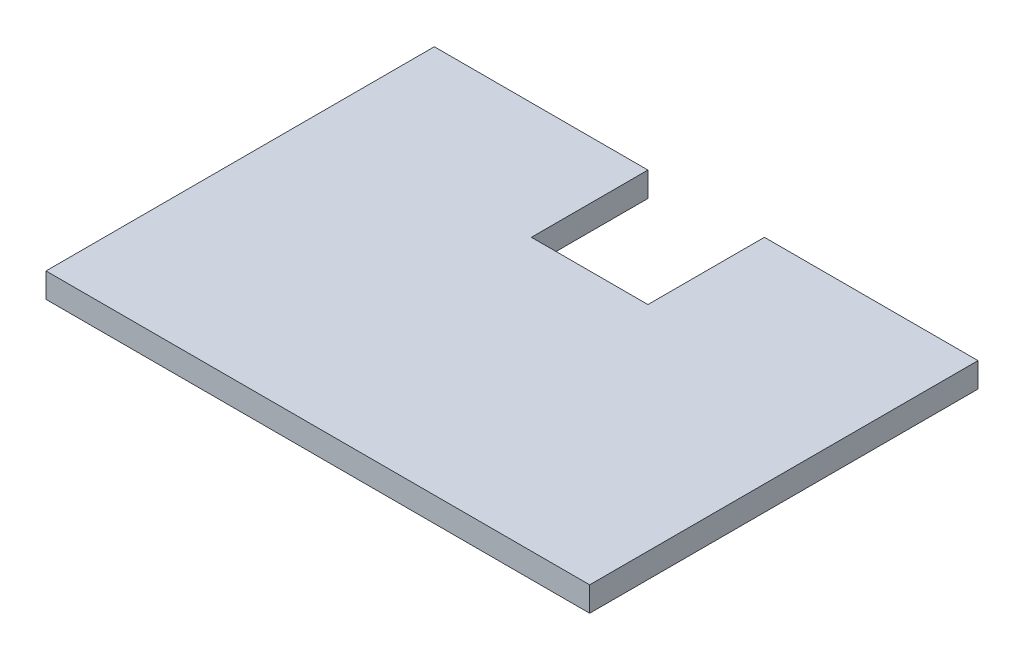
ISO-10303-21;
HEADER;
FILE_DESCRIPTION(('STEP AP214'),'2;1');
FILE_NAME('part.step','',(''),(''),'','','');
FILE_SCHEMA(('AUTOMOTIVE_DESIGN { 1 0 10303 214 1 1 1 1 }'));
ENDSEC;
DATA;
#1=APPLICATION_CONTEXT('core data for automotive mechanical design processes');
#2=APPLICATION_PROTOCOL_DEFINITION('international standard','automotive_design',2000,#1);
#3=PRODUCT_CONTEXT('',#1,'mechanical');
#4=PRODUCT('Part','Part','',(#3));
#5=PRODUCT_RELATED_PRODUCT_CATEGORY('part','',(#4));
#6=PRODUCT_DEFINITION_FORMATION('','',#4);
#7=PRODUCT_DEFINITION_CONTEXT('part definition',#1,'design');
#8=PRODUCT_DEFINITION('design','',#6,#7);
#9=PRODUCT_DEFINITION_SHAPE('','',#8);
#10=(LENGTH_UNIT() NAMED_UNIT(*) SI_UNIT(.MILLI.,.METRE.));
#11=(NAMED_UNIT(*) PLANE_ANGLE_UNIT() SI_UNIT($,.RADIAN.));
#12=(NAMED_UNIT(*) SI_UNIT($,.STERADIAN.) SOLID_ANGLE_UNIT());
#13=UNCERTAINTY_MEASURE_WITH_UNIT(LENGTH_MEASURE(1.E-05),#10,'distance_accuracy_value','');
#14=(GEOMETRIC_REPRESENTATION_CONTEXT(3) GLOBAL_UNCERTAINTY_ASSIGNED_CONTEXT((#13)) GLOBAL_UNIT_ASSIGNED_CONTEXT((#10,
#11,#12)) REPRESENTATION_CONTEXT('',''));
#15=CARTESIAN_POINT('',(0.,0.,0.));
#16=DIRECTION('',(0.,0.,1.));
#17=DIRECTION('',(1.,0.,0.));
#18=AXIS2_PLACEMENT_3D('',#15,#16,#17);
#19=CARTESIAN_POINT('',(-35.,3.175,-25.));
#20=DIRECTION('',(0.,0.,1.));
#21=DIRECTION('',(1.,0.,0.));
#22=AXIS2_PLACEMENT_3D('',#19,#20,#21);
#23=PLANE('',#22);
#24=DIRECTION('',(-1.,0.,0.));
#25=VECTOR('',#24,1.);
#26=CARTESIAN_POINT('',(-35.,3.175,-25.));
#27=LINE('',#26,#25);
#28=CARTESIAN_POINT('',(-7.49999999999999,3.175,-25.));
#29=VERTEX_POINT('',#28);
#30=CARTESIAN_POINT('',(-35.,3.175,-25.));
#31=VERTEX_POINT('',#30);
#32=EDGE_CURVE('E144',#29,#31,#27,.T.);
#33=ORIENTED_EDGE('',*,*,#32,.F.);
#34=DIRECTION('',(0.,1.,0.));
#35=VECTOR('',#34,1.);
#36=CARTESIAN_POINT('',(-7.49999999999999,0.,-25.));
#37=LINE('',#36,#35);
#38=CARTESIAN_POINT('',(-7.49999999999999,0.,-25.));
#39=VERTEX_POINT('',#38);
#40=EDGE_CURVE('E136',#39,#29,#37,.T.);
#41=ORIENTED_EDGE('',*,*,#40,.F.);
#42=DIRECTION('',(-1.,0.,0.));
#43=VECTOR('',#42,1.);
#44=CARTESIAN_POINT('',(-35.,0.,-25.));
#45=LINE('',#44,#43);
#46=CARTESIAN_POINT('',(-35.,0.,-25.));
#47=VERTEX_POINT('',#46);
#48=EDGE_CURVE('E127',#39,#47,#45,.T.);
#49=ORIENTED_EDGE('',*,*,#48,.T.);
#50=DIRECTION('',(0.,-1.,0.));
#51=VECTOR('',#50,1.);
#52=CARTESIAN_POINT('',(-35.,3.175,-25.));
#53=LINE('',#52,#51);
#54=EDGE_CURVE('E40',#31,#47,#53,.T.);
#55=ORIENTED_EDGE('',*,*,#54,.F.);
#56=EDGE_LOOP('',(#33,#41,#49,#55));
#57=FACE_BOUND('',#56,.T.);
#58=ADVANCED_FACE('F32',(#57),#23,.F.);
#59=CARTESIAN_POINT('',(35.,3.175,-25.));
#60=DIRECTION('',(-1.,0.,0.));
#61=DIRECTION('',(0.,0.,1.));
#62=AXIS2_PLACEMENT_3D('',#59,#60,#61);
#63=PLANE('',#62);
#64=DIRECTION('',(0.,0.,-1.));
#65=VECTOR('',#64,1.);
#66=CARTESIAN_POINT('',(35.,0.,-25.));
#67=LINE('',#66,#65);
#68=CARTESIAN_POINT('',(35.,0.,25.));
#69=VERTEX_POINT('',#68);
#70=CARTESIAN_POINT('',(35.,0.,-25.));
#71=VERTEX_POINT('',#70);
#72=EDGE_CURVE('E138',#69,#71,#67,.T.);
#73=ORIENTED_EDGE('',*,*,#72,.T.);
#74=DIRECTION('',(0.,-1.,0.));
#75=VECTOR('',#74,1.);
#76=CARTESIAN_POINT('',(35.,3.175,-25.));
#77=LINE('',#76,#75);
#78=CARTESIAN_POINT('',(35.,3.175,-25.));
#79=VERTEX_POINT('',#78);
#80=EDGE_CURVE('E11',#79,#71,#77,.T.);
#81=ORIENTED_EDGE('',*,*,#80,.F.);
#82=DIRECTION('',(0.,0.,-1.));
#83=VECTOR('',#82,1.);
#84=CARTESIAN_POINT('',(35.,3.175,-25.));
#85=LINE('',#84,#83);
#86=CARTESIAN_POINT('',(35.,3.175,25.));
#87=VERTEX_POINT('',#86);
#88=EDGE_CURVE('E142',#87,#79,#85,.T.);
#89=ORIENTED_EDGE('',*,*,#88,.F.);
#90=DIRECTION('',(0.,-1.,0.));
#91=VECTOR('',#90,1.);
#92=CARTESIAN_POINT('',(35.,3.175,25.));
#93=LINE('',#92,#91);
#94=EDGE_CURVE('E149',#87,#69,#93,.T.);
#95=ORIENTED_EDGE('',*,*,#94,.T.);
#96=EDGE_LOOP('',(#73,#81,#89,#95));
#97=FACE_BOUND('',#96,.T.);
#98=ADVANCED_FACE('F34',(#97),#63,.F.);
#99=CARTESIAN_POINT('',(7.5,0.,-25.));
#100=VERTEX_POINT('',#99);
#101=EDGE_CURVE('E152',#71,#100,#45,.T.);
#102=ORIENTED_EDGE('',*,*,#101,.T.);
#103=DIRECTION('',(0.,1.,0.));
#104=VECTOR('',#103,1.);
#105=CARTESIAN_POINT('',(7.5,0.,-25.));
#106=LINE('',#105,#104);
#107=CARTESIAN_POINT('',(7.5,3.175,-25.));
#108=VERTEX_POINT('',#107);
#109=EDGE_CURVE('E139',#100,#108,#106,.T.);
#110=ORIENTED_EDGE('',*,*,#109,.T.);
#111=EDGE_CURVE('E84',#79,#108,#27,.T.);
#112=ORIENTED_EDGE('',*,*,#111,.F.);
#113=ORIENTED_EDGE('',*,*,#80,.T.);
#114=EDGE_LOOP('',(#102,#110,#112,#113));
#115=FACE_BOUND('',#114,.T.);
#116=ADVANCED_FACE('F181',(#115),#23,.F.);
#117=CARTESIAN_POINT('',(-35.,3.175,-25.));
#118=DIRECTION('',(1.,0.,0.));
#119=DIRECTION('',(0.,0.,-1.));
#120=AXIS2_PLACEMENT_3D('',#117,#118,#119);
#121=PLANE('',#120);
#122=DIRECTION('',(0.,0.,1.));
#123=VECTOR('',#122,1.);
#124=CARTESIAN_POINT('',(-35.,0.,-25.));
#125=LINE('',#124,#123);
#126=CARTESIAN_POINT('',(-35.,0.,25.));
#127=VERTEX_POINT('',#126);
#128=EDGE_CURVE('E155',#47,#127,#125,.T.);
#129=ORIENTED_EDGE('',*,*,#128,.T.);
#130=DIRECTION('',(0.,-1.,0.));
#131=VECTOR('',#130,1.);
#132=CARTESIAN_POINT('',(-35.,3.175,25.));
#133=LINE('',#132,#131);
#134=CARTESIAN_POINT('',(-35.,3.175,25.));
#135=VERTEX_POINT('',#134);
#136=EDGE_CURVE('E159',#135,#127,#133,.T.);
#137=ORIENTED_EDGE('',*,*,#136,.F.);
#138=DIRECTION('',(0.,0.,1.));
#139=VECTOR('',#138,1.);
#140=CARTESIAN_POINT('',(-35.,3.175,-25.));
#141=LINE('',#140,#139);
#142=EDGE_CURVE('E146',#31,#135,#141,.T.);
#143=ORIENTED_EDGE('',*,*,#142,.F.);
#144=ORIENTED_EDGE('',*,*,#54,.T.);
#145=EDGE_LOOP('',(#129,#137,#143,#144));
#146=FACE_BOUND('',#145,.T.);
#147=ADVANCED_FACE('F164',(#146),#121,.F.);
#148=CARTESIAN_POINT('',(-35.,3.175,25.));
#149=DIRECTION('',(0.,0.,-1.));
#150=DIRECTION('',(-1.,0.,0.));
#151=AXIS2_PLACEMENT_3D('',#148,#149,#150);
#152=PLANE('',#151);
#153=DIRECTION('',(1.,0.,0.));
#154=VECTOR('',#153,1.);
#155=CARTESIAN_POINT('',(-35.,0.,25.));
#156=LINE('',#155,#154);
#157=EDGE_CURVE('E77',#127,#69,#156,.T.);
#158=ORIENTED_EDGE('',*,*,#157,.T.);
#159=ORIENTED_EDGE('',*,*,#94,.F.);
#160=DIRECTION('',(1.,0.,0.));
#161=VECTOR('',#160,1.);
#162=CARTESIAN_POINT('',(-35.,3.175,25.));
#163=LINE('',#162,#161);
#164=EDGE_CURVE('E56',#135,#87,#163,.T.);
#165=ORIENTED_EDGE('',*,*,#164,.F.);
#166=ORIENTED_EDGE('',*,*,#136,.T.);
#167=EDGE_LOOP('',(#158,#159,#165,#166));
#168=FACE_BOUND('',#167,.T.);
#169=ADVANCED_FACE('F172',(#168),#152,.F.);
#170=CARTESIAN_POINT('',(0.,3.175,0.));
#171=DIRECTION('',(0.,1.,0.));
#172=DIRECTION('',(0.,0.,1.));
#173=AXIS2_PLACEMENT_3D('',#170,#171,#172);
#174=PLANE('',#173);
#175=DIRECTION('',(0.,0.,1.));
#176=VECTOR('',#175,1.);
#177=CARTESIAN_POINT('',(-7.49999999999999,3.175,-25.));
#178=LINE('',#177,#176);
#179=CARTESIAN_POINT('',(-7.5,3.175,-10.));
#180=VERTEX_POINT('',#179);
#181=EDGE_CURVE('E113',#29,#180,#178,.T.);
#182=ORIENTED_EDGE('',*,*,#181,.F.);
#183=ORIENTED_EDGE('',*,*,#32,.T.);
#184=ORIENTED_EDGE('',*,*,#142,.T.);
#185=ORIENTED_EDGE('',*,*,#164,.T.);
#186=ORIENTED_EDGE('',*,*,#88,.T.);
#187=ORIENTED_EDGE('',*,*,#111,.T.);
#188=DIRECTION('',(0.,0.,-1.));
#189=VECTOR('',#188,1.);
#190=CARTESIAN_POINT('',(7.5,3.175,-25.));
#191=LINE('',#190,#189);
#192=CARTESIAN_POINT('',(7.5,3.175,-10.));
#193=VERTEX_POINT('',#192);
#194=EDGE_CURVE('E128',#193,#108,#191,.T.);
#195=ORIENTED_EDGE('',*,*,#194,.F.);
#196=DIRECTION('',(1.,0.,0.));
#197=VECTOR('',#196,1.);
#198=CARTESIAN_POINT('',(-7.5,3.175,-10.));
#199=LINE('',#198,#197);
#200=EDGE_CURVE('E130',#180,#193,#199,.T.);
#201=ORIENTED_EDGE('',*,*,#200,.F.);
#202=EDGE_LOOP('',(#182,#183,#184,#185,#186,#187,#195,#201));
#203=FACE_BOUND('',#202,.T.);
#204=ADVANCED_FACE('F174',(#203),#174,.T.);
#205=CARTESIAN_POINT('',(0.,0.,0.));
#206=DIRECTION('',(0.,1.,0.));
#207=DIRECTION('',(0.,0.,1.));
#208=AXIS2_PLACEMENT_3D('',#205,#206,#207);
#209=PLANE('',#208);
#210=ORIENTED_EDGE('',*,*,#48,.F.);
#211=DIRECTION('',(0.,0.,1.));
#212=VECTOR('',#211,1.);
#213=CARTESIAN_POINT('',(-7.49999999999999,0.,-25.));
#214=LINE('',#213,#212);
#215=CARTESIAN_POINT('',(-7.5,0.,-10.));
#216=VERTEX_POINT('',#215);
#217=EDGE_CURVE('E110',#39,#216,#214,.T.);
#218=ORIENTED_EDGE('',*,*,#217,.T.);
#219=DIRECTION('',(1.,0.,0.));
#220=VECTOR('',#219,1.);
#221=CARTESIAN_POINT('',(-7.5,0.,-10.));
#222=LINE('',#221,#220);
#223=CARTESIAN_POINT('',(7.5,0.,-10.));
#224=VERTEX_POINT('',#223);
#225=EDGE_CURVE('E120',#216,#224,#222,.T.);
#226=ORIENTED_EDGE('',*,*,#225,.T.);
#227=DIRECTION('',(0.,0.,-1.));
#228=VECTOR('',#227,1.);
#229=CARTESIAN_POINT('',(7.5,0.,-25.));
#230=LINE('',#229,#228);
#231=EDGE_CURVE('E47',#224,#100,#230,.T.);
#232=ORIENTED_EDGE('',*,*,#231,.T.);
#233=ORIENTED_EDGE('',*,*,#101,.F.);
#234=ORIENTED_EDGE('',*,*,#72,.F.);
#235=ORIENTED_EDGE('',*,*,#157,.F.);
#236=ORIENTED_EDGE('',*,*,#128,.F.);
#237=EDGE_LOOP('',(#210,#218,#226,#232,#233,#234,#235,#236));
#238=FACE_BOUND('',#237,.T.);
#239=ADVANCED_FACE('F125',(#238),#209,.F.);
#240=CARTESIAN_POINT('',(-7.49999999999999,0.,-25.));
#241=DIRECTION('',(-1.,0.,0.));
#242=DIRECTION('',(0.,0.,1.));
#243=AXIS2_PLACEMENT_3D('',#240,#241,#242);
#244=PLANE('',#243);
#245=ORIENTED_EDGE('',*,*,#181,.T.);
#246=DIRECTION('',(0.,1.,0.));
#247=VECTOR('',#246,1.);
#248=CARTESIAN_POINT('',(-7.5,0.,-10.));
#249=LINE('',#248,#247);
#250=EDGE_CURVE('E106',#216,#180,#249,.T.);
#251=ORIENTED_EDGE('',*,*,#250,.F.);
#252=ORIENTED_EDGE('',*,*,#217,.F.);
#253=ORIENTED_EDGE('',*,*,#40,.T.);
#254=EDGE_LOOP('',(#245,#251,#252,#253));
#255=FACE_BOUND('',#254,.T.);
#256=ADVANCED_FACE('F108',(#255),#244,.F.);
#257=CARTESIAN_POINT('',(7.5,0.,-25.));
#258=DIRECTION('',(1.,0.,0.));
#259=DIRECTION('',(0.,0.,-1.));
#260=AXIS2_PLACEMENT_3D('',#257,#258,#259);
#261=PLANE('',#260);
#262=ORIENTED_EDGE('',*,*,#194,.T.);
#263=ORIENTED_EDGE('',*,*,#109,.F.);
#264=ORIENTED_EDGE('',*,*,#231,.F.);
#265=DIRECTION('',(0.,1.,0.));
#266=VECTOR('',#265,1.);
#267=CARTESIAN_POINT('',(7.5,0.,-10.));
#268=LINE('',#267,#266);
#269=EDGE_CURVE('E117',#224,#193,#268,.T.);
#270=ORIENTED_EDGE('',*,*,#269,.T.);
#271=EDGE_LOOP('',(#262,#263,#264,#270));
#272=FACE_BOUND('',#271,.T.);
#273=ADVANCED_FACE('F192',(#272),#261,.F.);
#274=CARTESIAN_POINT('',(-7.5,0.,-10.));
#275=DIRECTION('',(0.,0.,1.));
#276=DIRECTION('',(1.,0.,0.));
#277=AXIS2_PLACEMENT_3D('',#274,#275,#276);
#278=PLANE('',#277);
#279=ORIENTED_EDGE('',*,*,#200,.T.);
#280=ORIENTED_EDGE('',*,*,#269,.F.);
#281=ORIENTED_EDGE('',*,*,#225,.F.);
#282=ORIENTED_EDGE('',*,*,#250,.T.);
#283=EDGE_LOOP('',(#279,#280,#281,#282));
#284=FACE_BOUND('',#283,.T.);
#285=ADVANCED_FACE('F121',(#284),#278,.F.);
#286=CLOSED_SHELL('',(#58,#98,#116,#147,#169,#204,#239,#256,#273,#285));
#287=MANIFOLD_SOLID_BREP('B2',#286);
#288=ADVANCED_BREP_SHAPE_REPRESENTATION('',(#18,#287),#14);
#289=SHAPE_DEFINITION_REPRESENTATION(#9,#288);
ENDSEC;
END-ISO-10303-21;
